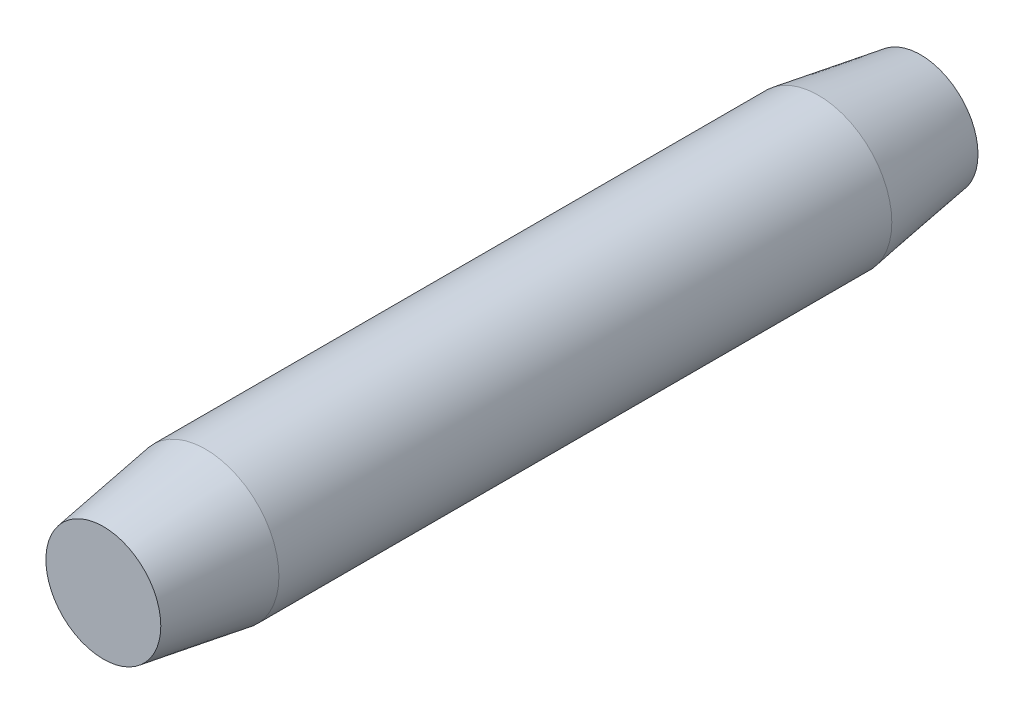
ISO-10303-21;
HEADER;
FILE_DESCRIPTION(('STEP AP214'),'2;1');
FILE_NAME('part.step','',(''),(''),'','','');
FILE_SCHEMA(('AUTOMOTIVE_DESIGN { 1 0 10303 214 1 1 1 1 }'));
ENDSEC;
DATA;
#1=APPLICATION_CONTEXT('core data for automotive mechanical design processes');
#2=APPLICATION_PROTOCOL_DEFINITION('international standard','automotive_design',2000,#1);
#3=PRODUCT_CONTEXT('',#1,'mechanical');
#4=PRODUCT('Part','Part','',(#3));
#5=PRODUCT_RELATED_PRODUCT_CATEGORY('part','',(#4));
#6=PRODUCT_DEFINITION_FORMATION('','',#4);
#7=PRODUCT_DEFINITION_CONTEXT('part definition',#1,'design');
#8=PRODUCT_DEFINITION('design','',#6,#7);
#9=PRODUCT_DEFINITION_SHAPE('','',#8);
#10=(LENGTH_UNIT() NAMED_UNIT(*) SI_UNIT(.MILLI.,.METRE.));
#11=(NAMED_UNIT(*) PLANE_ANGLE_UNIT() SI_UNIT($,.RADIAN.));
#12=(NAMED_UNIT(*) SI_UNIT($,.STERADIAN.) SOLID_ANGLE_UNIT());
#13=UNCERTAINTY_MEASURE_WITH_UNIT(LENGTH_MEASURE(1.E-05),#10,'distance_accuracy_value','');
#14=(GEOMETRIC_REPRESENTATION_CONTEXT(3) GLOBAL_UNCERTAINTY_ASSIGNED_CONTEXT((#13)) GLOBAL_UNIT_ASSIGNED_CONTEXT((#10,
#11,#12)) REPRESENTATION_CONTEXT('',''));
#15=CARTESIAN_POINT('',(0.,0.,0.));
#16=DIRECTION('',(0.,0.,1.));
#17=DIRECTION('',(1.,0.,0.));
#18=AXIS2_PLACEMENT_3D('',#15,#16,#17);
#19=CARTESIAN_POINT('',(0.,0.,101.6));
#20=DIRECTION('',(0.,0.,-1.));
#21=DIRECTION('',(-1.,0.,0.));
#22=AXIS2_PLACEMENT_3D('',#19,#20,#21);
#23=CYLINDRICAL_SURFACE('',#22,18.25625);
#24=CARTESIAN_POINT('',(0.,0.,-76.1999999999989));
#25=DIRECTION('',(0.,0.,1.));
#26=DIRECTION('',(1.,0.,0.));
#27=AXIS2_PLACEMENT_3D('',#24,#25,#26);
#28=CIRCLE('',#27,18.25625);
#29=CARTESIAN_POINT('',(18.25625,0.,-76.1999999999989));
#30=VERTEX_POINT('',#29);
#31=EDGE_CURVE('E42',#30,#30,#28,.T.);
#32=ORIENTED_EDGE('',*,*,#31,.T.);
#33=EDGE_LOOP('',(#32));
#34=FACE_BOUND('',#33,.T.);
#35=CARTESIAN_POINT('',(0.,0.,76.1999999999998));
#36=DIRECTION('',(0.,0.,1.));
#37=DIRECTION('',(1.,0.,0.));
#38=AXIS2_PLACEMENT_3D('',#35,#36,#37);
#39=CIRCLE('',#38,18.25625);
#40=CARTESIAN_POINT('',(18.25625,0.,76.1999999999998));
#41=VERTEX_POINT('',#40);
#42=EDGE_CURVE('E46',#41,#41,#39,.F.);
#43=ORIENTED_EDGE('',*,*,#42,.T.);
#44=EDGE_LOOP('',(#43));
#45=FACE_BOUND('',#44,.T.);
#46=ADVANCED_FACE('F35',(#34,#45),#23,.T.);
#47=CARTESIAN_POINT('',(0.,0.,101.6));
#48=DIRECTION('',(0.,0.,1.));
#49=DIRECTION('',(1.,0.,0.));
#50=AXIS2_PLACEMENT_3D('',#47,#48,#49);
#51=PLANE('',#50);
#52=CARTESIAN_POINT('',(0.,0.,101.6));
#53=DIRECTION('',(0.,0.,1.));
#54=DIRECTION('',(1.,0.,0.));
#55=AXIS2_PLACEMENT_3D('',#52,#53,#54);
#56=CIRCLE('',#55,14.2875000000001);
#57=CARTESIAN_POINT('',(14.2875000000001,0.,101.6));
#58=VERTEX_POINT('',#57);
#59=EDGE_CURVE('E50',#58,#58,#56,.T.);
#60=ORIENTED_EDGE('',*,*,#59,.T.);
#61=EDGE_LOOP('',(#60));
#62=FACE_BOUND('',#61,.T.);
#63=ADVANCED_FACE('F56',(#62),#51,.T.);
#64=CARTESIAN_POINT('',(0.,0.,-101.6));
#65=DIRECTION('',(0.,0.,1.));
#66=DIRECTION('',(1.,0.,0.));
#67=AXIS2_PLACEMENT_3D('',#64,#65,#66);
#68=PLANE('',#67);
#69=CARTESIAN_POINT('',(0.,0.,-101.6));
#70=DIRECTION('',(0.,0.,1.));
#71=DIRECTION('',(1.,0.,0.));
#72=AXIS2_PLACEMENT_3D('',#69,#70,#71);
#73=CIRCLE('',#72,14.2874999999999);
#74=CARTESIAN_POINT('',(14.2874999999999,0.,-101.6));
#75=VERTEX_POINT('',#74);
#76=EDGE_CURVE('E10',#75,#75,#73,.F.);
#77=ORIENTED_EDGE('',*,*,#76,.T.);
#78=EDGE_LOOP('',(#77));
#79=FACE_BOUND('',#78,.T.);
#80=ADVANCED_FACE('F60',(#79),#68,.F.);
#81=CARTESIAN_POINT('',(0.,0.,101.6));
#82=DIRECTION('',(0.,0.,-1.));
#83=DIRECTION('',(-1.,0.,0.));
#84=AXIS2_PLACEMENT_3D('',#81,#82,#83);
#85=CONICAL_SURFACE('',#84,14.2875000000001,0.154996741923938);
#86=ORIENTED_EDGE('',*,*,#42,.F.);
#87=EDGE_LOOP('',(#86));
#88=FACE_BOUND('',#87,.T.);
#89=ORIENTED_EDGE('',*,*,#59,.F.);
#90=EDGE_LOOP('',(#89));
#91=FACE_BOUND('',#90,.T.);
#92=ADVANCED_FACE('F58',(#88,#91),#85,.T.);
#93=CARTESIAN_POINT('',(0.,0.,-76.1999999999989));
#94=DIRECTION('',(0.,0.,1.));
#95=DIRECTION('',(1.,0.,0.));
#96=AXIS2_PLACEMENT_3D('',#93,#94,#95);
#97=CONICAL_SURFACE('',#96,18.25625,0.154996741923938);
#98=ORIENTED_EDGE('',*,*,#76,.F.);
#99=EDGE_LOOP('',(#98));
#100=FACE_BOUND('',#99,.T.);
#101=ORIENTED_EDGE('',*,*,#31,.F.);
#102=EDGE_LOOP('',(#101));
#103=FACE_BOUND('',#102,.T.);
#104=ADVANCED_FACE('F37',(#100,#103),#97,.T.);
#105=CLOSED_SHELL('',(#46,#63,#80,#92,#104));
#106=MANIFOLD_SOLID_BREP('B2',#105);
#107=ADVANCED_BREP_SHAPE_REPRESENTATION('',(#18,#106),#14);
#108=SHAPE_DEFINITION_REPRESENTATION(#9,#107);
ENDSEC;
END-ISO-10303-21;
